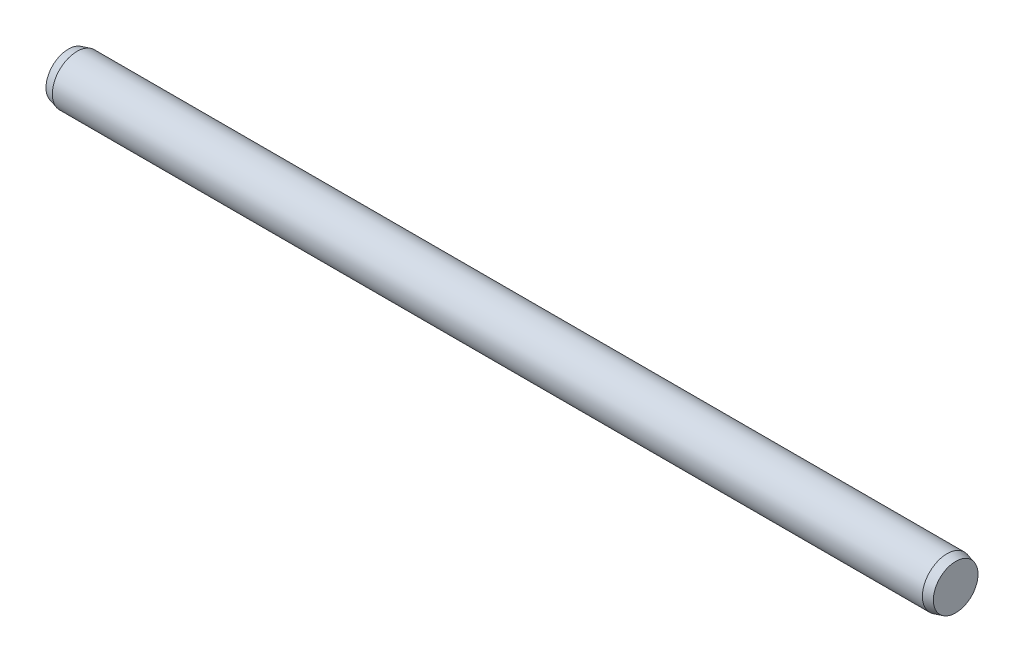
ISO-10303-21;
HEADER;
FILE_DESCRIPTION(('STEP AP214'),'2;1');
FILE_NAME('part.step','',(''),(''),'','','');
FILE_SCHEMA(('AUTOMOTIVE_DESIGN { 1 0 10303 214 1 1 1 1 }'));
ENDSEC;
DATA;
#1=APPLICATION_CONTEXT('core data for automotive mechanical design processes');
#2=APPLICATION_PROTOCOL_DEFINITION('international standard','automotive_design',2000,#1);
#3=PRODUCT_CONTEXT('',#1,'mechanical');
#4=PRODUCT('Part','Part','',(#3));
#5=PRODUCT_RELATED_PRODUCT_CATEGORY('part','',(#4));
#6=PRODUCT_DEFINITION_FORMATION('','',#4);
#7=PRODUCT_DEFINITION_CONTEXT('part definition',#1,'design');
#8=PRODUCT_DEFINITION('design','',#6,#7);
#9=PRODUCT_DEFINITION_SHAPE('','',#8);
#10=(LENGTH_UNIT() NAMED_UNIT(*) SI_UNIT(.MILLI.,.METRE.));
#11=(NAMED_UNIT(*) PLANE_ANGLE_UNIT() SI_UNIT($,.RADIAN.));
#12=(NAMED_UNIT(*) SI_UNIT($,.STERADIAN.) SOLID_ANGLE_UNIT());
#13=UNCERTAINTY_MEASURE_WITH_UNIT(LENGTH_MEASURE(1.E-05),#10,'distance_accuracy_value','');
#14=(GEOMETRIC_REPRESENTATION_CONTEXT(3) GLOBAL_UNCERTAINTY_ASSIGNED_CONTEXT((#13)) GLOBAL_UNIT_ASSIGNED_CONTEXT((#10,
#11,#12)) REPRESENTATION_CONTEXT('',''));
#15=CARTESIAN_POINT('',(0.,0.,0.));
#16=DIRECTION('',(0.,0.,1.));
#17=DIRECTION('',(1.,0.,0.));
#18=AXIS2_PLACEMENT_3D('',#15,#16,#17);
#19=CARTESIAN_POINT('',(-17.65,0.,0.));
#20=DIRECTION('',(1.,0.,0.));
#21=DIRECTION('',(0.,0.,-1.));
#22=AXIS2_PLACEMENT_3D('',#19,#20,#21);
#23=CYLINDRICAL_SURFACE('',#22,1.);
#24=CARTESIAN_POINT('',(-17.65,0.,0.));
#25=DIRECTION('',(-1.,0.,0.));
#26=DIRECTION('',(0.,0.,1.));
#27=AXIS2_PLACEMENT_3D('',#24,#25,#26);
#28=CIRCLE('',#27,1.);
#29=CARTESIAN_POINT('',(-17.65,0.,1.));
#30=VERTEX_POINT('',#29);
#31=EDGE_CURVE('E46',#30,#30,#28,.T.);
#32=ORIENTED_EDGE('',*,*,#31,.F.);
#33=EDGE_LOOP('',(#32));
#34=FACE_BOUND('',#33,.T.);
#35=CARTESIAN_POINT('',(17.65,0.,0.));
#36=DIRECTION('',(1.,0.,0.));
#37=DIRECTION('',(0.,0.,-1.));
#38=AXIS2_PLACEMENT_3D('',#35,#36,#37);
#39=CIRCLE('',#38,1.);
#40=CARTESIAN_POINT('',(17.65,0.,-1.));
#41=VERTEX_POINT('',#40);
#42=EDGE_CURVE('E10',#41,#41,#39,.T.);
#43=ORIENTED_EDGE('',*,*,#42,.F.);
#44=EDGE_LOOP('',(#43));
#45=FACE_BOUND('',#44,.T.);
#46=ADVANCED_FACE('F32',(#34,#45),#23,.T.);
#47=CARTESIAN_POINT('',(17.65,0.,0.));
#48=DIRECTION('',(-1.,0.,0.));
#49=DIRECTION('',(0.,0.,-1.));
#50=AXIS2_PLACEMENT_3D('',#47,#48,#49);
#51=CONICAL_SURFACE('',#50,1.,0.26179938779915);
#52=CARTESIAN_POINT('',(18.,0.,0.));
#53=DIRECTION('',(1.,0.,0.));
#54=DIRECTION('',(0.,0.,-1.));
#55=AXIS2_PLACEMENT_3D('',#52,#53,#54);
#56=CIRCLE('',#55,0.906217782649107);
#57=CARTESIAN_POINT('',(18.,0.,-0.906217782649107));
#58=VERTEX_POINT('',#57);
#59=EDGE_CURVE('E38',#58,#58,#56,.T.);
#60=ORIENTED_EDGE('',*,*,#59,.F.);
#61=EDGE_LOOP('',(#60));
#62=FACE_BOUND('',#61,.T.);
#63=ORIENTED_EDGE('',*,*,#42,.T.);
#64=EDGE_LOOP('',(#63));
#65=FACE_BOUND('',#64,.T.);
#66=ADVANCED_FACE('F56',(#62,#65),#51,.T.);
#67=CARTESIAN_POINT('',(18.,0.,0.));
#68=DIRECTION('',(1.,0.,0.));
#69=DIRECTION('',(0.,0.,-1.));
#70=AXIS2_PLACEMENT_3D('',#67,#68,#69);
#71=PLANE('',#70);
#72=ORIENTED_EDGE('',*,*,#59,.T.);
#73=EDGE_LOOP('',(#72));
#74=FACE_BOUND('',#73,.T.);
#75=ADVANCED_FACE('F60',(#74),#71,.T.);
#76=CARTESIAN_POINT('',(-17.65,0.,0.));
#77=DIRECTION('',(1.,0.,0.));
#78=DIRECTION('',(0.,0.,1.));
#79=AXIS2_PLACEMENT_3D('',#76,#77,#78);
#80=CONICAL_SURFACE('',#79,1.,0.26179938779915);
#81=CARTESIAN_POINT('',(-18.,0.,0.));
#82=DIRECTION('',(-1.,0.,0.));
#83=DIRECTION('',(0.,0.,1.));
#84=AXIS2_PLACEMENT_3D('',#81,#82,#83);
#85=CIRCLE('',#84,0.906217782649107);
#86=CARTESIAN_POINT('',(-18.,0.,0.906217782649107));
#87=VERTEX_POINT('',#86);
#88=EDGE_CURVE('E42',#87,#87,#85,.T.);
#89=ORIENTED_EDGE('',*,*,#88,.F.);
#90=EDGE_LOOP('',(#89));
#91=FACE_BOUND('',#90,.T.);
#92=ORIENTED_EDGE('',*,*,#31,.T.);
#93=EDGE_LOOP('',(#92));
#94=FACE_BOUND('',#93,.T.);
#95=ADVANCED_FACE('F52',(#91,#94),#80,.T.);
#96=CARTESIAN_POINT('',(-18.,0.,0.));
#97=DIRECTION('',(-1.,0.,0.));
#98=DIRECTION('',(0.,0.,1.));
#99=AXIS2_PLACEMENT_3D('',#96,#97,#98);
#100=PLANE('',#99);
#101=ORIENTED_EDGE('',*,*,#88,.T.);
#102=EDGE_LOOP('',(#101));
#103=FACE_BOUND('',#102,.T.);
#104=ADVANCED_FACE('F69',(#103),#100,.T.);
#105=CLOSED_SHELL('',(#46,#66,#75,#95,#104));
#106=MANIFOLD_SOLID_BREP('B2',#105);
#107=ADVANCED_BREP_SHAPE_REPRESENTATION('',(#18,#106),#14);
#108=SHAPE_DEFINITION_REPRESENTATION(#9,#107);
ENDSEC;
END-ISO-10303-21;
